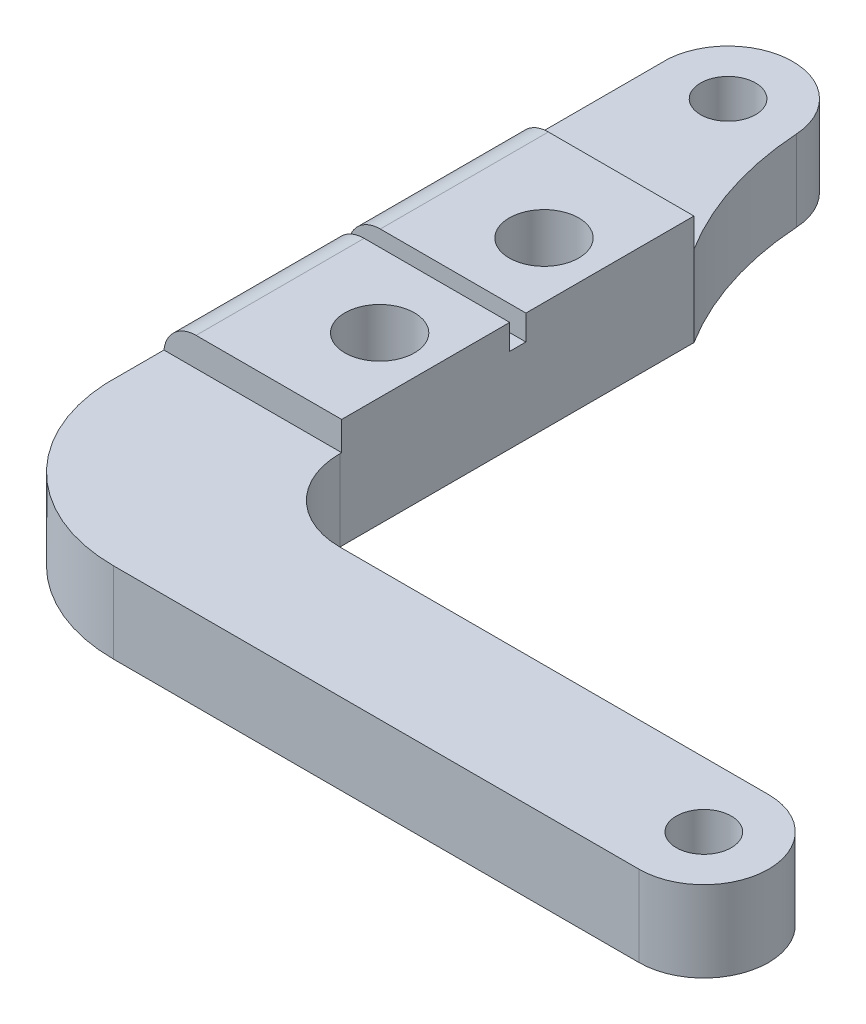
ISO-10303-21;
HEADER;
FILE_DESCRIPTION(('STEP AP214'),'2;1');
FILE_NAME('part.step','',(''),(''),'','','');
FILE_SCHEMA(('AUTOMOTIVE_DESIGN { 1 0 10303 214 1 1 1 1 }'));
ENDSEC;
DATA;
#1=APPLICATION_CONTEXT('core data for automotive mechanical design processes');
#2=APPLICATION_PROTOCOL_DEFINITION('international standard','automotive_design',2000,#1);
#3=PRODUCT_CONTEXT('',#1,'mechanical');
#4=PRODUCT('Part','Part','',(#3));
#5=PRODUCT_RELATED_PRODUCT_CATEGORY('part','',(#4));
#6=PRODUCT_DEFINITION_FORMATION('','',#4);
#7=PRODUCT_DEFINITION_CONTEXT('part definition',#1,'design');
#8=PRODUCT_DEFINITION('design','',#6,#7);
#9=PRODUCT_DEFINITION_SHAPE('','',#8);
#10=(LENGTH_UNIT() NAMED_UNIT(*) SI_UNIT(.MILLI.,.METRE.));
#11=(NAMED_UNIT(*) PLANE_ANGLE_UNIT() SI_UNIT($,.RADIAN.));
#12=(NAMED_UNIT(*) SI_UNIT($,.STERADIAN.) SOLID_ANGLE_UNIT());
#13=UNCERTAINTY_MEASURE_WITH_UNIT(LENGTH_MEASURE(1.E-05),#10,'distance_accuracy_value','');
#14=(GEOMETRIC_REPRESENTATION_CONTEXT(3) GLOBAL_UNCERTAINTY_ASSIGNED_CONTEXT((#13)) GLOBAL_UNIT_ASSIGNED_CONTEXT((#10,
#11,#12)) REPRESENTATION_CONTEXT('',''));
#15=CARTESIAN_POINT('',(0.,0.,0.));
#16=DIRECTION('',(0.,0.,1.));
#17=DIRECTION('',(1.,0.,0.));
#18=AXIS2_PLACEMENT_3D('',#15,#16,#17);
#19=CARTESIAN_POINT('',(4.,5.,30.89));
#20=DIRECTION('',(0.,0.,-1.));
#21=DIRECTION('',(-1.,0.,0.));
#22=AXIS2_PLACEMENT_3D('',#19,#20,#21);
#23=PLANE('',#22);
#24=DIRECTION('',(1.,0.,0.));
#25=VECTOR('',#24,1.);
#26=CARTESIAN_POINT('',(7.,6.78,30.89));
#27=LINE('',#26,#25);
#28=CARTESIAN_POINT('',(-2.,6.78,30.89));
#29=VERTEX_POINT('',#28);
#30=CARTESIAN_POINT('',(7.,6.78,30.89));
#31=VERTEX_POINT('',#30);
#32=EDGE_CURVE('E193',#29,#31,#27,.T.);
#33=ORIENTED_EDGE('',*,*,#32,.F.);
#34=CARTESIAN_POINT('',(-2.,4.78,30.89));
#35=DIRECTION('',(0.,0.,-1.));
#36=DIRECTION('',(-1.,0.,0.));
#37=AXIS2_PLACEMENT_3D('',#34,#35,#36);
#38=CIRCLE('',#37,2.);
#39=CARTESIAN_POINT('',(-3.98786317436588,5.,30.89));
#40=VERTEX_POINT('',#39);
#41=EDGE_CURVE('E280',#29,#40,#38,.F.);
#42=ORIENTED_EDGE('',*,*,#41,.T.);
#43=DIRECTION('',(1.,0.,0.));
#44=VECTOR('',#43,1.);
#45=CARTESIAN_POINT('',(7.,5.,30.89));
#46=LINE('',#45,#44);
#47=CARTESIAN_POINT('',(7.,5.,30.89));
#48=VERTEX_POINT('',#47);
#49=EDGE_CURVE('E182',#40,#48,#46,.T.);
#50=ORIENTED_EDGE('',*,*,#49,.T.);
#51=DIRECTION('',(0.,-1.,0.));
#52=VECTOR('',#51,1.);
#53=CARTESIAN_POINT('',(7.,5.,30.89));
#54=LINE('',#53,#52);
#55=EDGE_CURVE('E196',#31,#48,#54,.T.);
#56=ORIENTED_EDGE('',*,*,#55,.F.);
#57=EDGE_LOOP('',(#33,#42,#50,#56));
#58=FACE_BOUND('',#57,.T.);
#59=ADVANCED_FACE('F34',(#58),#23,.F.);
#60=CARTESIAN_POINT('',(0.,6.78,0.));
#61=DIRECTION('',(0.,-1.,0.));
#62=DIRECTION('',(0.,0.,-1.));
#63=AXIS2_PLACEMENT_3D('',#60,#61,#62);
#64=PLANE('',#63);
#65=CARTESIAN_POINT('',(3.54,6.78,14.92));
#66=DIRECTION('',(0.,1.,0.));
#67=DIRECTION('',(0.,0.,1.));
#68=AXIS2_PLACEMENT_3D('',#65,#66,#67);
#69=CIRCLE('',#68,2.15);
#70=CARTESIAN_POINT('',(3.54,6.78,17.07));
#71=VERTEX_POINT('',#70);
#72=EDGE_CURVE('E360',#71,#71,#69,.T.);
#73=ORIENTED_EDGE('',*,*,#72,.F.);
#74=EDGE_LOOP('',(#73));
#75=FACE_BOUND('',#74,.T.);
#76=DIRECTION('',(-1.,0.,0.));
#77=VECTOR('',#76,1.);
#78=CARTESIAN_POINT('',(7.,6.78,9.11));
#79=LINE('',#78,#77);
#80=CARTESIAN_POINT('',(7.,6.78,9.11));
#81=VERTEX_POINT('',#80);
#82=CARTESIAN_POINT('',(-2.,6.78,9.11000000000001));
#83=VERTEX_POINT('',#82);
#84=EDGE_CURVE('E190',#81,#83,#79,.T.);
#85=ORIENTED_EDGE('',*,*,#84,.T.);
#86=DIRECTION('',(0.,0.,1.));
#87=VECTOR('',#86,1.);
#88=CARTESIAN_POINT('',(-2.,6.78,0.));
#89=LINE('',#88,#87);
#90=CARTESIAN_POINT('',(-2.,6.78,19.5));
#91=VERTEX_POINT('',#90);
#92=EDGE_CURVE('E270',#83,#91,#89,.T.);
#93=ORIENTED_EDGE('',*,*,#92,.T.);
#94=DIRECTION('',(1.,0.,0.));
#95=VECTOR('',#94,1.);
#96=CARTESIAN_POINT('',(0.,6.78,19.5));
#97=LINE('',#96,#95);
#98=CARTESIAN_POINT('',(7.00000000000002,6.78,19.5));
#99=VERTEX_POINT('',#98);
#100=EDGE_CURVE('E249',#91,#99,#97,.T.);
#101=ORIENTED_EDGE('',*,*,#100,.T.);
#102=DIRECTION('',(0.,0.,-1.));
#103=VECTOR('',#102,1.);
#104=CARTESIAN_POINT('',(7.,6.78,9.11));
#105=LINE('',#104,#103);
#106=EDGE_CURVE('E184',#99,#81,#105,.T.);
#107=ORIENTED_EDGE('',*,*,#106,.T.);
#108=EDGE_LOOP('',(#85,#93,#101,#107));
#109=FACE_BOUND('',#108,.T.);
#110=ADVANCED_FACE('F327',(#75,#109),#64,.F.);
#111=CARTESIAN_POINT('',(38.5,5.,40.));
#112=DIRECTION('',(0.,1.,0.));
#113=DIRECTION('',(0.,0.,1.));
#114=AXIS2_PLACEMENT_3D('',#111,#112,#113);
#115=PLANE('',#114);
#116=ORIENTED_EDGE('',*,*,#49,.F.);
#117=DIRECTION('',(0.,0.,1.));
#118=VECTOR('',#117,1.);
#119=CARTESIAN_POINT('',(-3.98786317436588,5.,30.89));
#120=LINE('',#119,#118);
#121=CARTESIAN_POINT('',(-3.98786317436588,5.,34.4925334609404));
#122=VERTEX_POINT('',#121);
#123=EDGE_CURVE('E282',#40,#122,#120,.T.);
#124=ORIENTED_EDGE('',*,*,#123,.T.);
#125=CARTESIAN_POINT('',(6.,5.,34.));
#126=DIRECTION('',(0.,1.,0.));
#127=DIRECTION('',(0.,0.,1.));
#128=AXIS2_PLACEMENT_3D('',#125,#126,#127);
#129=CIRCLE('',#128,10.);
#130=CARTESIAN_POINT('',(6.,5.,44.));
#131=VERTEX_POINT('',#130);
#132=EDGE_CURVE('E268',#122,#131,#129,.T.);
#133=ORIENTED_EDGE('',*,*,#132,.T.);
#134=DIRECTION('',(1.,0.,0.));
#135=VECTOR('',#134,1.);
#136=CARTESIAN_POINT('',(-4.,5.,44.));
#137=LINE('',#136,#135);
#138=CARTESIAN_POINT('',(38.5,5.,44.));
#139=VERTEX_POINT('',#138);
#140=EDGE_CURVE('E212',#131,#139,#137,.T.);
#141=ORIENTED_EDGE('',*,*,#140,.T.);
#142=CARTESIAN_POINT('',(38.5,5.,40.));
#143=DIRECTION('',(0.,1.,0.));
#144=DIRECTION('',(0.,0.,1.));
#145=AXIS2_PLACEMENT_3D('',#142,#143,#144);
#146=CIRCLE('',#145,4.);
#147=CARTESIAN_POINT('',(38.5,5.,36.));
#148=VERTEX_POINT('',#147);
#149=EDGE_CURVE('E215',#139,#148,#146,.T.);
#150=ORIENTED_EDGE('',*,*,#149,.T.);
#151=DIRECTION('',(-1.,0.,0.));
#152=VECTOR('',#151,1.);
#153=CARTESIAN_POINT('',(4.,5.,36.));
#154=LINE('',#153,#152);
#155=CARTESIAN_POINT('',(12.,5.,36.));
#156=VERTEX_POINT('',#155);
#157=EDGE_CURVE('E217',#148,#156,#154,.T.);
#158=ORIENTED_EDGE('',*,*,#157,.T.);
#159=CARTESIAN_POINT('',(12.,5.,31.));
#160=DIRECTION('',(0.,1.,0.));
#161=DIRECTION('',(0.,0.,1.));
#162=AXIS2_PLACEMENT_3D('',#159,#160,#161);
#163=CIRCLE('',#162,5.);
#164=CARTESIAN_POINT('',(7.,5.,31.));
#165=VERTEX_POINT('',#164);
#166=EDGE_CURVE('E258',#156,#165,#163,.F.);
#167=ORIENTED_EDGE('',*,*,#166,.T.);
#168=DIRECTION('',(0.,0.,1.));
#169=VECTOR('',#168,1.);
#170=CARTESIAN_POINT('',(7.,5.,36.));
#171=LINE('',#170,#169);
#172=EDGE_CURVE('E348',#48,#165,#171,.T.);
#173=ORIENTED_EDGE('',*,*,#172,.F.);
#174=EDGE_LOOP('',(#116,#124,#133,#141,#150,#158,#167,#173));
#175=FACE_BOUND('',#174,.T.);
#176=CARTESIAN_POINT('',(38.5,5.,40.));
#177=DIRECTION('',(0.,1.,0.));
#178=DIRECTION('',(0.,0.,1.));
#179=AXIS2_PLACEMENT_3D('',#176,#177,#178);
#180=CIRCLE('',#179,1.69999999999999);
#181=CARTESIAN_POINT('',(38.5,5.,41.7));
#182=VERTEX_POINT('',#181);
#183=EDGE_CURVE('E203',#182,#182,#180,.T.);
#184=ORIENTED_EDGE('',*,*,#183,.F.);
#185=EDGE_LOOP('',(#184));
#186=FACE_BOUND('',#185,.T.);
#187=ADVANCED_FACE('F325',(#175,#186),#115,.T.);
#188=CARTESIAN_POINT('',(7.,5.,9.11));
#189=DIRECTION('',(-1.,0.,0.));
#190=DIRECTION('',(0.,0.,1.));
#191=AXIS2_PLACEMENT_3D('',#188,#189,#190);
#192=PLANE('',#191);
#193=ORIENTED_EDGE('',*,*,#172,.T.);
#194=DIRECTION('',(0.,-1.,0.));
#195=VECTOR('',#194,1.);
#196=CARTESIAN_POINT('',(7.,0.,31.));
#197=LINE('',#196,#195);
#198=CARTESIAN_POINT('',(7.,0.,31.));
#199=VERTEX_POINT('',#198);
#200=EDGE_CURVE('E251',#165,#199,#197,.T.);
#201=ORIENTED_EDGE('',*,*,#200,.T.);
#202=DIRECTION('',(0.,0.,-1.));
#203=VECTOR('',#202,1.);
#204=CARTESIAN_POINT('',(7.,0.,9.11));
#205=LINE('',#204,#203);
#206=CARTESIAN_POINT('',(7.,0.,9.11));
#207=VERTEX_POINT('',#206);
#208=EDGE_CURVE('E209',#199,#207,#205,.T.);
#209=ORIENTED_EDGE('',*,*,#208,.T.);
#210=DIRECTION('',(0.,-1.,0.));
#211=VECTOR('',#210,1.);
#212=CARTESIAN_POINT('',(7.,5.,9.11));
#213=LINE('',#212,#211);
#214=CARTESIAN_POINT('',(7.,5.,9.11));
#215=VERTEX_POINT('',#214);
#216=EDGE_CURVE('E242',#215,#207,#213,.T.);
#217=ORIENTED_EDGE('',*,*,#216,.F.);
#218=EDGE_CURVE('E243',#81,#215,#213,.T.);
#219=ORIENTED_EDGE('',*,*,#218,.F.);
#220=ORIENTED_EDGE('',*,*,#106,.F.);
#221=DIRECTION('',(0.,-1.,0.));
#222=VECTOR('',#221,1.);
#223=CARTESIAN_POINT('',(7.,5.,19.5));
#224=LINE('',#223,#222);
#225=CARTESIAN_POINT('',(7.00000000000002,5.23,19.5));
#226=VERTEX_POINT('',#225);
#227=EDGE_CURVE('E166',#99,#226,#224,.T.);
#228=ORIENTED_EDGE('',*,*,#227,.T.);
#229=DIRECTION('',(0.,0.,1.));
#230=VECTOR('',#229,1.);
#231=CARTESIAN_POINT('',(7.,5.23000000000002,9.11));
#232=LINE('',#231,#230);
#233=CARTESIAN_POINT('',(7.00000000000002,5.23,20.5));
#234=VERTEX_POINT('',#233);
#235=EDGE_CURVE('E171',#226,#234,#232,.T.);
#236=ORIENTED_EDGE('',*,*,#235,.T.);
#237=DIRECTION('',(0.,1.,0.));
#238=VECTOR('',#237,1.);
#239=CARTESIAN_POINT('',(7.,4.99999999999998,20.5));
#240=LINE('',#239,#238);
#241=CARTESIAN_POINT('',(7.00000000000002,6.78,20.5));
#242=VERTEX_POINT('',#241);
#243=EDGE_CURVE('E155',#234,#242,#240,.T.);
#244=ORIENTED_EDGE('',*,*,#243,.T.);
#245=EDGE_CURVE('E188',#31,#242,#105,.T.);
#246=ORIENTED_EDGE('',*,*,#245,.F.);
#247=ORIENTED_EDGE('',*,*,#55,.T.);
#248=EDGE_LOOP('',(#193,#201,#209,#217,#219,#220,#228,#236,#244,#246,#247));
#249=FACE_BOUND('',#248,.T.);
#250=ADVANCED_FACE('F179',(#249),#192,.F.);
#251=CARTESIAN_POINT('',(4.,5.,9.11));
#252=DIRECTION('',(0.,0.,1.));
#253=DIRECTION('',(1.,0.,0.));
#254=AXIS2_PLACEMENT_3D('',#251,#252,#253);
#255=PLANE('',#254);
#256=ORIENTED_EDGE('',*,*,#218,.T.);
#257=DIRECTION('',(-1.,0.,0.));
#258=VECTOR('',#257,1.);
#259=CARTESIAN_POINT('',(7.,5.,9.11));
#260=LINE('',#259,#258);
#261=CARTESIAN_POINT('',(-3.98786317436588,5.,9.11));
#262=VERTEX_POINT('',#261);
#263=EDGE_CURVE('E48',#215,#262,#260,.T.);
#264=ORIENTED_EDGE('',*,*,#263,.T.);
#265=CARTESIAN_POINT('',(-2.,4.78,9.11));
#266=DIRECTION('',(0.,0.,1.));
#267=DIRECTION('',(1.,0.,0.));
#268=AXIS2_PLACEMENT_3D('',#265,#266,#267);
#269=CIRCLE('',#268,2.);
#270=EDGE_CURVE('E408',#262,#83,#269,.F.);
#271=ORIENTED_EDGE('',*,*,#270,.T.);
#272=ORIENTED_EDGE('',*,*,#84,.F.);
#273=EDGE_LOOP('',(#256,#264,#271,#272));
#274=FACE_BOUND('',#273,.T.);
#275=ADVANCED_FACE('F317',(#274),#255,.F.);
#276=CARTESIAN_POINT('',(0.,5.,0.));
#277=DIRECTION('',(0.,-1.,0.));
#278=DIRECTION('',(0.,0.,-1.));
#279=AXIS2_PLACEMENT_3D('',#276,#277,#278);
#280=CYLINDRICAL_SURFACE('',#279,4.);
#281=CARTESIAN_POINT('',(0.,5.,0.));
#282=DIRECTION('',(0.,1.,0.));
#283=DIRECTION('',(0.,0.,1.));
#284=AXIS2_PLACEMENT_3D('',#281,#282,#283);
#285=CIRCLE('',#284,4.);
#286=CARTESIAN_POINT('',(3.99216837004188,5.,-0.25018334324477));
#287=VERTEX_POINT('',#286);
#288=CARTESIAN_POINT('',(-3.98786317436588,5.,-0.311363617875413));
#289=VERTEX_POINT('',#288);
#290=EDGE_CURVE('E210',#287,#289,#285,.T.);
#291=ORIENTED_EDGE('',*,*,#290,.F.);
#292=DIRECTION('',(0.,-1.,0.));
#293=VECTOR('',#292,1.);
#294=CARTESIAN_POINT('',(3.99216837004188,5.,-0.25018334324477));
#295=LINE('',#294,#293);
#296=CARTESIAN_POINT('',(3.99216837004188,0.,-0.25018334324477));
#297=VERTEX_POINT('',#296);
#298=EDGE_CURVE('E402',#287,#297,#295,.T.);
#299=ORIENTED_EDGE('',*,*,#298,.T.);
#300=CARTESIAN_POINT('',(0.,0.,0.));
#301=DIRECTION('',(0.,1.,0.));
#302=DIRECTION('',(0.,0.,1.));
#303=AXIS2_PLACEMENT_3D('',#300,#301,#302);
#304=CIRCLE('',#303,4.);
#305=CARTESIAN_POINT('',(-4.,0.,0.));
#306=VERTEX_POINT('',#305);
#307=EDGE_CURVE('E223',#297,#306,#304,.T.);
#308=ORIENTED_EDGE('',*,*,#307,.T.);
#309=DIRECTION('',(0.,-1.,0.));
#310=VECTOR('',#309,1.);
#311=CARTESIAN_POINT('',(-4.,5.,0.));
#312=LINE('',#311,#310);
#313=CARTESIAN_POINT('',(-4.,4.78,0.));
#314=VERTEX_POINT('',#313);
#315=EDGE_CURVE('E239',#314,#306,#312,.T.);
#316=ORIENTED_EDGE('',*,*,#315,.F.);
#317=CARTESIAN_POINT('',(-3.98786317436588,5.,-0.311363617875413));
#318=CARTESIAN_POINT('',(-3.99568620848284,4.92917395312161,-0.211045407910694));
#319=CARTESIAN_POINT('',(-3.99972737257322,4.85827494091366,-0.110700188105158));
#320=CARTESIAN_POINT('',(-3.99999556004515,4.78486872808644,-0.00688533741330715));
#321=CARTESIAN_POINT('',(-4.00000000449947,4.78243440696106,-0.00344268459370585));
#322=CARTESIAN_POINT('',(-4.,4.78,0.));
#323=B_SPLINE_CURVE_WITH_KNOTS('',3,(#317,#318,#319,#320,#321,#322),.UNSPECIFIED.,.F.,.F.,(4,2,
4),(0.,0.368794626714942,0.381443744382929),.UNSPECIFIED.);
#324=EDGE_CURVE('E301',#314,#289,#323,.F.);
#325=ORIENTED_EDGE('',*,*,#324,.T.);
#326=EDGE_LOOP('',(#291,#299,#308,#316,#325));
#327=FACE_BOUND('',#326,.T.);
#328=ADVANCED_FACE('F311',(#327),#280,.T.);
#329=CARTESIAN_POINT('',(-4.,5.,44.));
#330=DIRECTION('',(1.,0.,0.));
#331=DIRECTION('',(0.,0.,-1.));
#332=AXIS2_PLACEMENT_3D('',#329,#330,#331);
#333=PLANE('',#332);
#334=DIRECTION('',(0.,-1.,0.));
#335=VECTOR('',#334,1.);
#336=CARTESIAN_POINT('',(-4.,5.,34.));
#337=LINE('',#336,#335);
#338=CARTESIAN_POINT('',(-4.,0.,34.));
#339=VERTEX_POINT('',#338);
#340=CARTESIAN_POINT('',(-4.,4.78,34.));
#341=VERTEX_POINT('',#340);
#342=EDGE_CURVE('E265',#339,#341,#337,.F.);
#343=ORIENTED_EDGE('',*,*,#342,.T.);
#344=DIRECTION('',(0.,0.,1.));
#345=VECTOR('',#344,1.);
#346=CARTESIAN_POINT('',(-4.,4.78,44.));
#347=LINE('',#346,#345);
#348=EDGE_CURVE('E291',#341,#314,#347,.F.);
#349=ORIENTED_EDGE('',*,*,#348,.T.);
#350=ORIENTED_EDGE('',*,*,#315,.T.);
#351=DIRECTION('',(0.,0.,1.));
#352=VECTOR('',#351,1.);
#353=CARTESIAN_POINT('',(-4.,0.,44.));
#354=LINE('',#353,#352);
#355=EDGE_CURVE('E225',#306,#339,#354,.T.);
#356=ORIENTED_EDGE('',*,*,#355,.T.);
#357=EDGE_LOOP('',(#343,#349,#350,#356));
#358=FACE_BOUND('',#357,.T.);
#359=ADVANCED_FACE('F316',(#358),#333,.F.);
#360=CARTESIAN_POINT('',(-4.,5.,44.));
#361=DIRECTION('',(0.,0.,-1.));
#362=DIRECTION('',(-1.,0.,0.));
#363=AXIS2_PLACEMENT_3D('',#360,#361,#362);
#364=PLANE('',#363);
#365=ORIENTED_EDGE('',*,*,#140,.F.);
#366=DIRECTION('',(0.,-1.,0.));
#367=VECTOR('',#366,1.);
#368=CARTESIAN_POINT('',(6.,5.,44.));
#369=LINE('',#368,#367);
#370=CARTESIAN_POINT('',(6.,0.,44.));
#371=VERTEX_POINT('',#370);
#372=EDGE_CURVE('E260',#131,#371,#369,.T.);
#373=ORIENTED_EDGE('',*,*,#372,.T.);
#374=DIRECTION('',(1.,0.,0.));
#375=VECTOR('',#374,1.);
#376=CARTESIAN_POINT('',(-4.,0.,44.));
#377=LINE('',#376,#375);
#378=CARTESIAN_POINT('',(38.5,0.,44.));
#379=VERTEX_POINT('',#378);
#380=EDGE_CURVE('E228',#371,#379,#377,.T.);
#381=ORIENTED_EDGE('',*,*,#380,.T.);
#382=DIRECTION('',(0.,-1.,0.));
#383=VECTOR('',#382,1.);
#384=CARTESIAN_POINT('',(38.5,5.,44.));
#385=LINE('',#384,#383);
#386=EDGE_CURVE('E236',#139,#379,#385,.T.);
#387=ORIENTED_EDGE('',*,*,#386,.F.);
#388=EDGE_LOOP('',(#365,#373,#381,#387));
#389=FACE_BOUND('',#388,.T.);
#390=ADVANCED_FACE('F391',(#389),#364,.F.);
#391=CARTESIAN_POINT('',(38.5,5.,40.));
#392=DIRECTION('',(0.,-1.,0.));
#393=DIRECTION('',(0.,0.,-1.));
#394=AXIS2_PLACEMENT_3D('',#391,#392,#393);
#395=CYLINDRICAL_SURFACE('',#394,4.);
#396=CARTESIAN_POINT('',(38.5,0.,40.));
#397=DIRECTION('',(0.,1.,0.));
#398=DIRECTION('',(0.,0.,1.));
#399=AXIS2_PLACEMENT_3D('',#396,#397,#398);
#400=CIRCLE('',#399,4.);
#401=CARTESIAN_POINT('',(38.5,0.,36.));
#402=VERTEX_POINT('',#401);
#403=EDGE_CURVE('E230',#379,#402,#400,.T.);
#404=ORIENTED_EDGE('',*,*,#403,.T.);
#405=DIRECTION('',(0.,-1.,0.));
#406=VECTOR('',#405,1.);
#407=CARTESIAN_POINT('',(38.5,5.,36.));
#408=LINE('',#407,#406);
#409=EDGE_CURVE('E220',#148,#402,#408,.T.);
#410=ORIENTED_EDGE('',*,*,#409,.F.);
#411=ORIENTED_EDGE('',*,*,#149,.F.);
#412=ORIENTED_EDGE('',*,*,#386,.T.);
#413=EDGE_LOOP('',(#404,#410,#411,#412));
#414=FACE_BOUND('',#413,.T.);
#415=ADVANCED_FACE('F396',(#414),#395,.T.);
#416=CARTESIAN_POINT('',(4.,5.,36.));
#417=DIRECTION('',(0.,0.,1.));
#418=DIRECTION('',(1.,0.,0.));
#419=AXIS2_PLACEMENT_3D('',#416,#417,#418);
#420=PLANE('',#419);
#421=DIRECTION('',(-1.,0.,0.));
#422=VECTOR('',#421,1.);
#423=CARTESIAN_POINT('',(4.,0.,36.));
#424=LINE('',#423,#422);
#425=CARTESIAN_POINT('',(12.,0.,36.));
#426=VERTEX_POINT('',#425);
#427=EDGE_CURVE('E213',#402,#426,#424,.T.);
#428=ORIENTED_EDGE('',*,*,#427,.T.);
#429=DIRECTION('',(0.,-1.,0.));
#430=VECTOR('',#429,1.);
#431=CARTESIAN_POINT('',(12.,5.,36.));
#432=LINE('',#431,#430);
#433=EDGE_CURVE('E254',#426,#156,#432,.F.);
#434=ORIENTED_EDGE('',*,*,#433,.T.);
#435=ORIENTED_EDGE('',*,*,#157,.F.);
#436=ORIENTED_EDGE('',*,*,#409,.T.);
#437=EDGE_LOOP('',(#428,#434,#435,#436));
#438=FACE_BOUND('',#437,.T.);
#439=ADVANCED_FACE('F399',(#438),#420,.F.);
#440=ORIENTED_EDGE('',*,*,#263,.F.);
#441=CARTESIAN_POINT('',(23.9530102202513,5.,-1.50110005946862));
#442=DIRECTION('',(0.,1.,0.));
#443=DIRECTION('',(0.,0.,1.));
#444=AXIS2_PLACEMENT_3D('',#441,#442,#443);
#445=CIRCLE('',#444,20.);
#446=EDGE_CURVE('E11',#215,#287,#445,.F.);
#447=ORIENTED_EDGE('',*,*,#446,.T.);
#448=ORIENTED_EDGE('',*,*,#290,.T.);
#449=DIRECTION('',(0.,0.,1.));
#450=VECTOR('',#449,1.);
#451=CARTESIAN_POINT('',(-3.98786317436588,5.,-0.311363617875413));
#452=LINE('',#451,#450);
#453=EDGE_CURVE('E309',#289,#262,#452,.T.);
#454=ORIENTED_EDGE('',*,*,#453,.T.);
#455=EDGE_LOOP('',(#440,#447,#448,#454));
#456=FACE_BOUND('',#455,.T.);
#457=CARTESIAN_POINT('',(0.,5.,0.));
#458=DIRECTION('',(0.,1.,0.));
#459=DIRECTION('',(0.,0.,1.));
#460=AXIS2_PLACEMENT_3D('',#457,#458,#459);
#461=CIRCLE('',#460,1.69999999999999);
#462=CARTESIAN_POINT('',(0.,5.,1.69999999999999));
#463=VERTEX_POINT('',#462);
#464=EDGE_CURVE('E195',#463,#463,#461,.T.);
#465=ORIENTED_EDGE('',*,*,#464,.F.);
#466=EDGE_LOOP('',(#465));
#467=FACE_BOUND('',#466,.T.);
#468=ADVANCED_FACE('F404',(#456,#467),#115,.T.);
#469=CARTESIAN_POINT('',(38.5,0.,40.));
#470=DIRECTION('',(0.,1.,0.));
#471=DIRECTION('',(0.,0.,1.));
#472=AXIS2_PLACEMENT_3D('',#469,#470,#471);
#473=PLANE('',#472);
#474=ORIENTED_EDGE('',*,*,#380,.F.);
#475=CARTESIAN_POINT('',(6.,0.,34.));
#476=DIRECTION('',(0.,1.,0.));
#477=DIRECTION('',(0.,0.,1.));
#478=AXIS2_PLACEMENT_3D('',#475,#476,#477);
#479=CIRCLE('',#478,10.);
#480=EDGE_CURVE('E263',#371,#339,#479,.F.);
#481=ORIENTED_EDGE('',*,*,#480,.T.);
#482=ORIENTED_EDGE('',*,*,#355,.F.);
#483=ORIENTED_EDGE('',*,*,#307,.F.);
#484=CARTESIAN_POINT('',(23.9530102202513,0.,-1.50110005946862));
#485=DIRECTION('',(0.,1.,0.));
#486=DIRECTION('',(0.,0.,1.));
#487=AXIS2_PLACEMENT_3D('',#484,#485,#486);
#488=CIRCLE('',#487,20.);
#489=EDGE_CURVE('E42',#297,#207,#488,.T.);
#490=ORIENTED_EDGE('',*,*,#489,.T.);
#491=ORIENTED_EDGE('',*,*,#208,.F.);
#492=CARTESIAN_POINT('',(12.,0.,31.));
#493=DIRECTION('',(0.,1.,0.));
#494=DIRECTION('',(0.,0.,1.));
#495=AXIS2_PLACEMENT_3D('',#492,#493,#494);
#496=CIRCLE('',#495,5.);
#497=EDGE_CURVE('E256',#199,#426,#496,.T.);
#498=ORIENTED_EDGE('',*,*,#497,.T.);
#499=ORIENTED_EDGE('',*,*,#427,.F.);
#500=ORIENTED_EDGE('',*,*,#403,.F.);
#501=EDGE_LOOP('',(#474,#481,#482,#483,#490,#491,#498,#499,#500));
#502=FACE_BOUND('',#501,.T.);
#503=CARTESIAN_POINT('',(3.54,0.,25.08));
#504=DIRECTION('',(0.,1.,0.));
#505=DIRECTION('',(0.,0.,1.));
#506=AXIS2_PLACEMENT_3D('',#503,#504,#505);
#507=CIRCLE('',#506,2.15);
#508=CARTESIAN_POINT('',(3.54,0.,27.23));
#509=VERTEX_POINT('',#508);
#510=EDGE_CURVE('E355',#509,#509,#507,.T.);
#511=ORIENTED_EDGE('',*,*,#510,.T.);
#512=EDGE_LOOP('',(#511));
#513=FACE_BOUND('',#512,.T.);
#514=CARTESIAN_POINT('',(3.54,0.,14.92));
#515=DIRECTION('',(0.,1.,0.));
#516=DIRECTION('',(0.,0.,1.));
#517=AXIS2_PLACEMENT_3D('',#514,#515,#516);
#518=CIRCLE('',#517,2.15);
#519=CARTESIAN_POINT('',(3.54,0.,17.07));
#520=VERTEX_POINT('',#519);
#521=EDGE_CURVE('E363',#520,#520,#518,.T.);
#522=ORIENTED_EDGE('',*,*,#521,.T.);
#523=EDGE_LOOP('',(#522));
#524=FACE_BOUND('',#523,.T.);
#525=CARTESIAN_POINT('',(0.,0.,0.));
#526=DIRECTION('',(0.,1.,0.));
#527=DIRECTION('',(0.,0.,1.));
#528=AXIS2_PLACEMENT_3D('',#525,#526,#527);
#529=CIRCLE('',#528,1.7);
#530=CARTESIAN_POINT('',(0.,0.,1.7));
#531=VERTEX_POINT('',#530);
#532=EDGE_CURVE('E200',#531,#531,#529,.T.);
#533=ORIENTED_EDGE('',*,*,#532,.T.);
#534=EDGE_LOOP('',(#533));
#535=FACE_BOUND('',#534,.T.);
#536=CARTESIAN_POINT('',(38.5,0.,40.));
#537=DIRECTION('',(0.,1.,0.));
#538=DIRECTION('',(0.,0.,1.));
#539=AXIS2_PLACEMENT_3D('',#536,#537,#538);
#540=CIRCLE('',#539,1.7);
#541=CARTESIAN_POINT('',(38.5,0.,41.7));
#542=VERTEX_POINT('',#541);
#543=EDGE_CURVE('E206',#542,#542,#540,.T.);
#544=ORIENTED_EDGE('',*,*,#543,.T.);
#545=EDGE_LOOP('',(#544));
#546=FACE_BOUND('',#545,.T.);
#547=ADVANCED_FACE('F386',(#502,#513,#524,#535,#546),#473,.F.);
#548=CARTESIAN_POINT('',(38.5,5.,40.));
#549=DIRECTION('',(0.,1.,0.));
#550=DIRECTION('',(0.,0.,1.));
#551=AXIS2_PLACEMENT_3D('',#548,#549,#550);
#552=CYLINDRICAL_SURFACE('',#551,1.69999999999999);
#553=ORIENTED_EDGE('',*,*,#543,.F.);
#554=EDGE_LOOP('',(#553));
#555=FACE_BOUND('',#554,.T.);
#556=ORIENTED_EDGE('',*,*,#183,.T.);
#557=EDGE_LOOP('',(#556));
#558=FACE_BOUND('',#557,.T.);
#559=ADVANCED_FACE('F429',(#555,#558),#552,.F.);
#560=CARTESIAN_POINT('',(0.,5.,0.));
#561=DIRECTION('',(0.,1.,0.));
#562=DIRECTION('',(0.,0.,1.));
#563=AXIS2_PLACEMENT_3D('',#560,#561,#562);
#564=CYLINDRICAL_SURFACE('',#563,1.69999999999999);
#565=ORIENTED_EDGE('',*,*,#532,.F.);
#566=EDGE_LOOP('',(#565));
#567=FACE_BOUND('',#566,.T.);
#568=ORIENTED_EDGE('',*,*,#464,.T.);
#569=EDGE_LOOP('',(#568));
#570=FACE_BOUND('',#569,.T.);
#571=ADVANCED_FACE('F425',(#567,#570),#564,.F.);
#572=CARTESIAN_POINT('',(3.54,6.78,25.08));
#573=DIRECTION('',(0.,1.,0.));
#574=DIRECTION('',(0.,0.,1.));
#575=AXIS2_PLACEMENT_3D('',#572,#573,#574);
#576=CIRCLE('',#575,2.15);
#577=CARTESIAN_POINT('',(3.54,6.78,27.23));
#578=VERTEX_POINT('',#577);
#579=EDGE_CURVE('E352',#578,#578,#576,.T.);
#580=ORIENTED_EDGE('',*,*,#579,.F.);
#581=EDGE_LOOP('',(#580));
#582=FACE_BOUND('',#581,.T.);
#583=DIRECTION('',(-1.,0.,0.));
#584=VECTOR('',#583,1.);
#585=CARTESIAN_POINT('',(0.,6.78,20.5));
#586=LINE('',#585,#584);
#587=CARTESIAN_POINT('',(-2.,6.78,20.5));
#588=VERTEX_POINT('',#587);
#589=EDGE_CURVE('E161',#242,#588,#586,.T.);
#590=ORIENTED_EDGE('',*,*,#589,.T.);
#591=DIRECTION('',(0.,0.,1.));
#592=VECTOR('',#591,1.);
#593=CARTESIAN_POINT('',(-2.,6.78,25.695));
#594=LINE('',#593,#592);
#595=EDGE_CURVE('E278',#588,#29,#594,.T.);
#596=ORIENTED_EDGE('',*,*,#595,.T.);
#597=ORIENTED_EDGE('',*,*,#32,.T.);
#598=ORIENTED_EDGE('',*,*,#245,.T.);
#599=EDGE_LOOP('',(#590,#596,#597,#598));
#600=FACE_BOUND('',#599,.T.);
#601=ADVANCED_FACE('F372',(#582,#600),#64,.F.);
#602=CARTESIAN_POINT('',(42.5,5.23,19.5));
#603=DIRECTION('',(0.,-1.,0.));
#604=DIRECTION('',(0.,0.,-1.));
#605=AXIS2_PLACEMENT_3D('',#602,#603,#604);
#606=PLANE('',#605);
#607=DIRECTION('',(-1.,0.,0.));
#608=VECTOR('',#607,1.);
#609=CARTESIAN_POINT('',(42.5,5.23,19.5));
#610=LINE('',#609,#608);
#611=CARTESIAN_POINT('',(-3.94871752699049,5.23,19.5));
#612=VERTEX_POINT('',#611);
#613=EDGE_CURVE('E175',#226,#612,#610,.T.);
#614=ORIENTED_EDGE('',*,*,#613,.T.);
#615=DIRECTION('',(0.,0.,1.));
#616=VECTOR('',#615,1.);
#617=CARTESIAN_POINT('',(-3.9487175269905,5.23,19.5));
#618=LINE('',#617,#616);
#619=CARTESIAN_POINT('',(-3.94871752699051,5.23,20.5));
#620=VERTEX_POINT('',#619);
#621=EDGE_CURVE('E174',#612,#620,#618,.T.);
#622=ORIENTED_EDGE('',*,*,#621,.T.);
#623=DIRECTION('',(-1.,0.,0.));
#624=VECTOR('',#623,1.);
#625=CARTESIAN_POINT('',(42.5,5.23,20.5));
#626=LINE('',#625,#624);
#627=EDGE_CURVE('E158',#234,#620,#626,.T.);
#628=ORIENTED_EDGE('',*,*,#627,.F.);
#629=ORIENTED_EDGE('',*,*,#235,.F.);
#630=EDGE_LOOP('',(#614,#622,#628,#629));
#631=FACE_BOUND('',#630,.T.);
#632=ADVANCED_FACE('F170',(#631),#606,.F.);
#633=CARTESIAN_POINT('',(42.5,6.78,19.5));
#634=DIRECTION('',(0.,0.,-1.));
#635=DIRECTION('',(-1.,0.,0.));
#636=AXIS2_PLACEMENT_3D('',#633,#634,#635);
#637=PLANE('',#636);
#638=ORIENTED_EDGE('',*,*,#100,.F.);
#639=CARTESIAN_POINT('',(-2.,4.78,19.5));
#640=DIRECTION('',(0.,0.,-1.));
#641=DIRECTION('',(-1.,0.,0.));
#642=AXIS2_PLACEMENT_3D('',#639,#640,#641);
#643=CIRCLE('',#642,2.);
#644=EDGE_CURVE('E273',#91,#612,#643,.F.);
#645=ORIENTED_EDGE('',*,*,#644,.T.);
#646=ORIENTED_EDGE('',*,*,#613,.F.);
#647=ORIENTED_EDGE('',*,*,#227,.F.);
#648=EDGE_LOOP('',(#638,#645,#646,#647));
#649=FACE_BOUND('',#648,.T.);
#650=ADVANCED_FACE('F413',(#649),#637,.F.);
#651=CARTESIAN_POINT('',(42.5,6.78,20.5));
#652=DIRECTION('',(0.,0.,1.));
#653=DIRECTION('',(0.,-1.,0.));
#654=AXIS2_PLACEMENT_3D('',#651,#652,#653);
#655=PLANE('',#654);
#656=ORIENTED_EDGE('',*,*,#627,.T.);
#657=CARTESIAN_POINT('',(-2.,4.78,20.5));
#658=DIRECTION('',(0.,0.,1.));
#659=DIRECTION('',(0.,-1.,0.));
#660=AXIS2_PLACEMENT_3D('',#657,#658,#659);
#661=CIRCLE('',#660,2.);
#662=EDGE_CURVE('E276',#620,#588,#661,.F.);
#663=ORIENTED_EDGE('',*,*,#662,.T.);
#664=ORIENTED_EDGE('',*,*,#589,.F.);
#665=ORIENTED_EDGE('',*,*,#243,.F.);
#666=EDGE_LOOP('',(#656,#663,#664,#665));
#667=FACE_BOUND('',#666,.T.);
#668=ADVANCED_FACE('F157',(#667),#655,.F.);
#669=CARTESIAN_POINT('',(3.54,6.78,14.92));
#670=DIRECTION('',(0.,1.,0.));
#671=DIRECTION('',(0.,0.,1.));
#672=AXIS2_PLACEMENT_3D('',#669,#670,#671);
#673=CYLINDRICAL_SURFACE('',#672,2.15);
#674=ORIENTED_EDGE('',*,*,#521,.F.);
#675=EDGE_LOOP('',(#674));
#676=FACE_BOUND('',#675,.T.);
#677=ORIENTED_EDGE('',*,*,#72,.T.);
#678=EDGE_LOOP('',(#677));
#679=FACE_BOUND('',#678,.T.);
#680=ADVANCED_FACE('F338',(#676,#679),#673,.F.);
#681=CARTESIAN_POINT('',(3.54,6.78,25.08));
#682=DIRECTION('',(0.,1.,0.));
#683=DIRECTION('',(0.,0.,1.));
#684=AXIS2_PLACEMENT_3D('',#681,#682,#683);
#685=CYLINDRICAL_SURFACE('',#684,2.15);
#686=ORIENTED_EDGE('',*,*,#510,.F.);
#687=EDGE_LOOP('',(#686));
#688=FACE_BOUND('',#687,.T.);
#689=ORIENTED_EDGE('',*,*,#579,.T.);
#690=EDGE_LOOP('',(#689));
#691=FACE_BOUND('',#690,.T.);
#692=ADVANCED_FACE('F331',(#688,#691),#685,.F.);
#693=CARTESIAN_POINT('',(12.,5.,31.));
#694=DIRECTION('',(0.,1.,0.));
#695=DIRECTION('',(0.,0.,1.));
#696=AXIS2_PLACEMENT_3D('',#693,#694,#695);
#697=CYLINDRICAL_SURFACE('',#696,5.);
#698=ORIENTED_EDGE('',*,*,#166,.F.);
#699=ORIENTED_EDGE('',*,*,#433,.F.);
#700=ORIENTED_EDGE('',*,*,#497,.F.);
#701=ORIENTED_EDGE('',*,*,#200,.F.);
#702=EDGE_LOOP('',(#698,#699,#700,#701));
#703=FACE_BOUND('',#702,.T.);
#704=ADVANCED_FACE('F329',(#703),#697,.F.);
#705=CARTESIAN_POINT('',(6.,5.,34.));
#706=DIRECTION('',(0.,-1.,0.));
#707=DIRECTION('',(0.,0.,-1.));
#708=AXIS2_PLACEMENT_3D('',#705,#706,#707);
#709=CYLINDRICAL_SURFACE('',#708,10.);
#710=ORIENTED_EDGE('',*,*,#132,.F.);
#711=CARTESIAN_POINT('',(-3.98786317436588,5.,34.4925334609404));
#712=CARTESIAN_POINT('',(-3.99565455392879,4.92947832460193,34.334450865359));
#713=CARTESIAN_POINT('',(-3.99969460691022,4.85886664275828,34.1763588529305));
#714=CARTESIAN_POINT('',(-3.99999444724749,4.78544343634271,34.012171629723));
#715=CARTESIAN_POINT('',(-4.00000000281076,4.78272178485303,34.006085821838));
#716=CARTESIAN_POINT('',(-4.,4.78,34.));
#717=B_SPLINE_CURVE_WITH_KNOTS('',3,(#711,#712,#713,#714,#715,#716),.UNSPECIFIED.,.F.,.F.,(4,2,
4),(0.,0.519575542448855,0.539575549393328),.UNSPECIFIED.);
#718=EDGE_CURVE('E284',#122,#341,#717,.T.);
#719=ORIENTED_EDGE('',*,*,#718,.T.);
#720=ORIENTED_EDGE('',*,*,#342,.F.);
#721=ORIENTED_EDGE('',*,*,#480,.F.);
#722=ORIENTED_EDGE('',*,*,#372,.F.);
#723=EDGE_LOOP('',(#710,#719,#720,#721,#722));
#724=FACE_BOUND('',#723,.T.);
#725=ADVANCED_FACE('F293',(#724),#709,.T.);
#726=CARTESIAN_POINT('',(-2.,4.78,0.));
#727=DIRECTION('',(0.,0.,1.));
#728=DIRECTION('',(1.,0.,0.));
#729=AXIS2_PLACEMENT_3D('',#726,#727,#728);
#730=CYLINDRICAL_SURFACE('',#729,2.);
#731=ORIENTED_EDGE('',*,*,#324,.F.);
#732=ORIENTED_EDGE('',*,*,#348,.F.);
#733=ORIENTED_EDGE('',*,*,#718,.F.);
#734=ORIENTED_EDGE('',*,*,#123,.F.);
#735=ORIENTED_EDGE('',*,*,#41,.F.);
#736=ORIENTED_EDGE('',*,*,#595,.F.);
#737=ORIENTED_EDGE('',*,*,#662,.F.);
#738=ORIENTED_EDGE('',*,*,#621,.F.);
#739=ORIENTED_EDGE('',*,*,#644,.F.);
#740=ORIENTED_EDGE('',*,*,#92,.F.);
#741=ORIENTED_EDGE('',*,*,#270,.F.);
#742=ORIENTED_EDGE('',*,*,#453,.F.);
#743=EDGE_LOOP('',(#731,#732,#733,#734,#735,#736,#737,#738,#739,#740,#741,#742));
#744=FACE_BOUND('',#743,.T.);
#745=ADVANCED_FACE('F296',(#744),#730,.T.);
#746=CARTESIAN_POINT('',(23.9530102202513,5.,-1.50110005946862));
#747=DIRECTION('',(0.,1.,0.));
#748=DIRECTION('',(0.,0.,1.));
#749=AXIS2_PLACEMENT_3D('',#746,#747,#748);
#750=CYLINDRICAL_SURFACE('',#749,20.);
#751=ORIENTED_EDGE('',*,*,#446,.F.);
#752=ORIENTED_EDGE('',*,*,#216,.T.);
#753=ORIENTED_EDGE('',*,*,#489,.F.);
#754=ORIENTED_EDGE('',*,*,#298,.F.);
#755=EDGE_LOOP('',(#751,#752,#753,#754));
#756=FACE_BOUND('',#755,.T.);
#757=ADVANCED_FACE('F36',(#756),#750,.F.);
#758=CLOSED_SHELL('',(#59,#110,#187,#250,#275,#328,#359,#390,#415,#439,#468,#547,#559,#571,#601,
#632,#650,#668,#680,#692,#704,#725,#745,#757));
#759=MANIFOLD_SOLID_BREP('B2',#758);
#760=ADVANCED_BREP_SHAPE_REPRESENTATION('',(#18,#759),#14);
#761=SHAPE_DEFINITION_REPRESENTATION(#9,#760);
ENDSEC;
END-ISO-10303-21;
